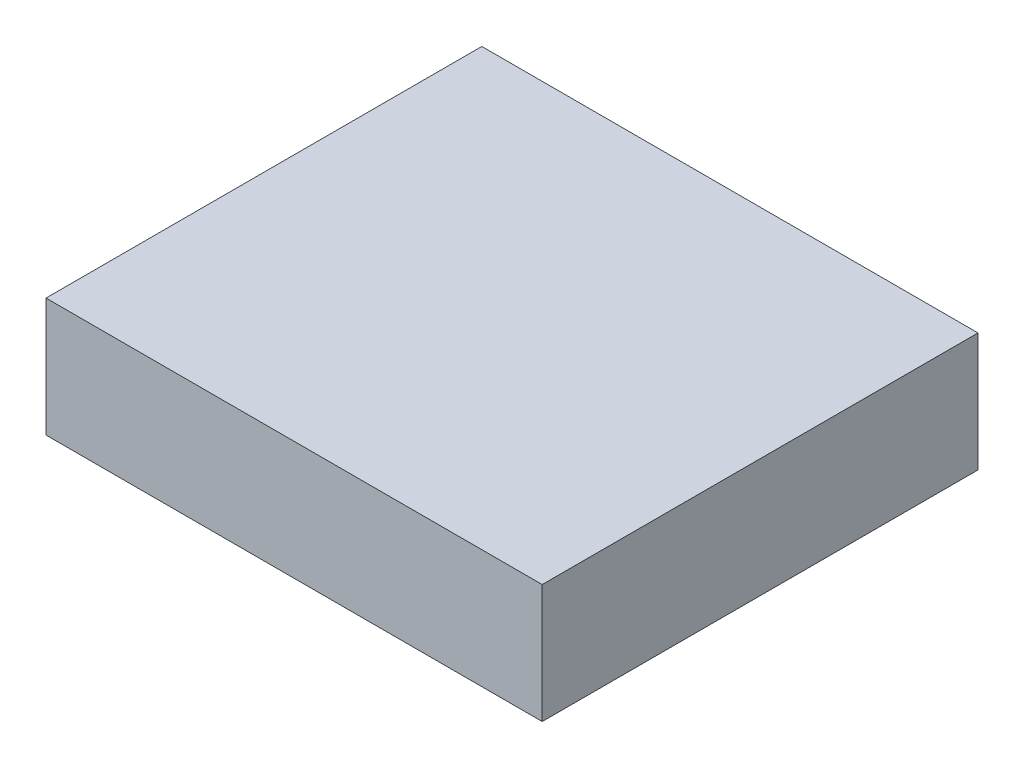
ISO-10303-21;
HEADER;
FILE_DESCRIPTION(('STEP AP214'),'2;1');
FILE_NAME('part.step','',(''),(''),'','','');
FILE_SCHEMA(('AUTOMOTIVE_DESIGN { 1 0 10303 214 1 1 1 1 }'));
ENDSEC;
DATA;
#1=APPLICATION_CONTEXT('core data for automotive mechanical design processes');
#2=APPLICATION_PROTOCOL_DEFINITION('international standard','automotive_design',2000,#1);
#3=PRODUCT_CONTEXT('',#1,'mechanical');
#4=PRODUCT('Part','Part','',(#3));
#5=PRODUCT_RELATED_PRODUCT_CATEGORY('part','',(#4));
#6=PRODUCT_DEFINITION_FORMATION('','',#4);
#7=PRODUCT_DEFINITION_CONTEXT('part definition',#1,'design');
#8=PRODUCT_DEFINITION('design','',#6,#7);
#9=PRODUCT_DEFINITION_SHAPE('','',#8);
#10=(LENGTH_UNIT() NAMED_UNIT(*) SI_UNIT(.MILLI.,.METRE.));
#11=(NAMED_UNIT(*) PLANE_ANGLE_UNIT() SI_UNIT($,.RADIAN.));
#12=(NAMED_UNIT(*) SI_UNIT($,.STERADIAN.) SOLID_ANGLE_UNIT());
#13=UNCERTAINTY_MEASURE_WITH_UNIT(LENGTH_MEASURE(1.E-05),#10,'distance_accuracy_value','');
#14=(GEOMETRIC_REPRESENTATION_CONTEXT(3) GLOBAL_UNCERTAINTY_ASSIGNED_CONTEXT((#13)) GLOBAL_UNIT_ASSIGNED_CONTEXT((#10,
#11,#12)) REPRESENTATION_CONTEXT('',''));
#15=CARTESIAN_POINT('',(0.,0.,0.));
#16=DIRECTION('',(0.,0.,1.));
#17=DIRECTION('',(1.,0.,0.));
#18=AXIS2_PLACEMENT_3D('',#15,#16,#17);
#19=CARTESIAN_POINT('',(-57.5,0.,50.5));
#20=DIRECTION('',(1.,0.,0.));
#21=DIRECTION('',(0.,0.,-1.));
#22=AXIS2_PLACEMENT_3D('',#19,#20,#21);
#23=PLANE('',#22);
#24=DIRECTION('',(0.,1.,0.));
#25=VECTOR('',#24,1.);
#26=CARTESIAN_POINT('',(-57.5,13.75,50.5));
#27=LINE('',#26,#25);
#28=CARTESIAN_POINT('',(-57.5,0.,50.5));
#29=VERTEX_POINT('',#28);
#30=CARTESIAN_POINT('',(-57.5,27.5,50.5));
#31=VERTEX_POINT('',#30);
#32=EDGE_CURVE('E21',#29,#31,#27,.T.);
#33=ORIENTED_EDGE('',*,*,#32,.T.);
#34=DIRECTION('',(0.,0.,-1.));
#35=VECTOR('',#34,1.);
#36=CARTESIAN_POINT('',(-57.5,27.5,0.));
#37=LINE('',#36,#35);
#38=CARTESIAN_POINT('',(-57.5,27.5,-50.5));
#39=VERTEX_POINT('',#38);
#40=EDGE_CURVE('E56',#31,#39,#37,.T.);
#41=ORIENTED_EDGE('',*,*,#40,.T.);
#42=DIRECTION('',(0.,-1.,0.));
#43=VECTOR('',#42,1.);
#44=CARTESIAN_POINT('',(-57.5,13.75,-50.5));
#45=LINE('',#44,#43);
#46=CARTESIAN_POINT('',(-57.5,0.,-50.5));
#47=VERTEX_POINT('',#46);
#48=EDGE_CURVE('E77',#39,#47,#45,.T.);
#49=ORIENTED_EDGE('',*,*,#48,.T.);
#50=DIRECTION('',(0.,0.,-1.));
#51=VECTOR('',#50,1.);
#52=CARTESIAN_POINT('',(-57.5,0.,0.));
#53=LINE('',#52,#51);
#54=EDGE_CURVE('E59',#29,#47,#53,.T.);
#55=ORIENTED_EDGE('',*,*,#54,.F.);
#56=EDGE_LOOP('',(#33,#41,#49,#55));
#57=FACE_BOUND('',#56,.T.);
#58=ADVANCED_FACE('F17',(#57),#23,.F.);
#59=CARTESIAN_POINT('',(57.5,0.,50.5));
#60=DIRECTION('',(0.,0.,-1.));
#61=DIRECTION('',(-1.,0.,0.));
#62=AXIS2_PLACEMENT_3D('',#59,#60,#61);
#63=PLANE('',#62);
#64=DIRECTION('',(0.,1.,0.));
#65=VECTOR('',#64,1.);
#66=CARTESIAN_POINT('',(57.5,13.75,50.5));
#67=LINE('',#66,#65);
#68=CARTESIAN_POINT('',(57.5,0.,50.5));
#69=VERTEX_POINT('',#68);
#70=CARTESIAN_POINT('',(57.5,27.5,50.5));
#71=VERTEX_POINT('',#70);
#72=EDGE_CURVE('E74',#69,#71,#67,.T.);
#73=ORIENTED_EDGE('',*,*,#72,.T.);
#74=DIRECTION('',(-1.,0.,0.));
#75=VECTOR('',#74,1.);
#76=CARTESIAN_POINT('',(0.,27.5,50.5));
#77=LINE('',#76,#75);
#78=EDGE_CURVE('E64',#71,#31,#77,.T.);
#79=ORIENTED_EDGE('',*,*,#78,.T.);
#80=ORIENTED_EDGE('',*,*,#32,.F.);
#81=DIRECTION('',(-1.,0.,0.));
#82=VECTOR('',#81,1.);
#83=CARTESIAN_POINT('',(0.,0.,50.5));
#84=LINE('',#83,#82);
#85=EDGE_CURVE('E79',#69,#29,#84,.T.);
#86=ORIENTED_EDGE('',*,*,#85,.F.);
#87=EDGE_LOOP('',(#73,#79,#80,#86));
#88=FACE_BOUND('',#87,.T.);
#89=ADVANCED_FACE('F73',(#88),#63,.F.);
#90=CARTESIAN_POINT('',(-57.5,27.5,50.5));
#91=DIRECTION('',(0.,-1.,0.));
#92=DIRECTION('',(0.,0.,-1.));
#93=AXIS2_PLACEMENT_3D('',#90,#91,#92);
#94=PLANE('',#93);
#95=DIRECTION('',(-1.,0.,0.));
#96=VECTOR('',#95,1.);
#97=CARTESIAN_POINT('',(0.,27.5,-50.5));
#98=LINE('',#97,#96);
#99=CARTESIAN_POINT('',(57.5,27.5,-50.5));
#100=VERTEX_POINT('',#99);
#101=EDGE_CURVE('E70',#100,#39,#98,.T.);
#102=ORIENTED_EDGE('',*,*,#101,.T.);
#103=ORIENTED_EDGE('',*,*,#40,.F.);
#104=ORIENTED_EDGE('',*,*,#78,.F.);
#105=DIRECTION('',(0.,0.,-1.));
#106=VECTOR('',#105,1.);
#107=CARTESIAN_POINT('',(57.5,27.5,0.));
#108=LINE('',#107,#106);
#109=EDGE_CURVE('E84',#71,#100,#108,.T.);
#110=ORIENTED_EDGE('',*,*,#109,.T.);
#111=EDGE_LOOP('',(#102,#103,#104,#110));
#112=FACE_BOUND('',#111,.T.);
#113=ADVANCED_FACE('F67',(#112),#94,.F.);
#114=CARTESIAN_POINT('',(-57.5,0.,-50.5));
#115=DIRECTION('',(0.,0.,1.));
#116=DIRECTION('',(1.,0.,0.));
#117=AXIS2_PLACEMENT_3D('',#114,#115,#116);
#118=PLANE('',#117);
#119=ORIENTED_EDGE('',*,*,#48,.F.);
#120=ORIENTED_EDGE('',*,*,#101,.F.);
#121=DIRECTION('',(0.,-1.,0.));
#122=VECTOR('',#121,1.);
#123=CARTESIAN_POINT('',(57.5,13.75,-50.5));
#124=LINE('',#123,#122);
#125=CARTESIAN_POINT('',(57.5,0.,-50.5));
#126=VERTEX_POINT('',#125);
#127=EDGE_CURVE('E27',#100,#126,#124,.T.);
#128=ORIENTED_EDGE('',*,*,#127,.T.);
#129=DIRECTION('',(1.,0.,0.));
#130=VECTOR('',#129,1.);
#131=CARTESIAN_POINT('',(0.,0.,-50.5));
#132=LINE('',#131,#130);
#133=EDGE_CURVE('E35',#47,#126,#132,.T.);
#134=ORIENTED_EDGE('',*,*,#133,.F.);
#135=EDGE_LOOP('',(#119,#120,#128,#134));
#136=FACE_BOUND('',#135,.T.);
#137=ADVANCED_FACE('F89',(#136),#118,.F.);
#138=CARTESIAN_POINT('',(-57.5,0.,50.5));
#139=DIRECTION('',(0.,-1.,0.));
#140=DIRECTION('',(0.,0.,-1.));
#141=AXIS2_PLACEMENT_3D('',#138,#139,#140);
#142=PLANE('',#141);
#143=ORIENTED_EDGE('',*,*,#54,.T.);
#144=ORIENTED_EDGE('',*,*,#133,.T.);
#145=DIRECTION('',(0.,0.,1.));
#146=VECTOR('',#145,1.);
#147=CARTESIAN_POINT('',(57.5,0.,0.));
#148=LINE('',#147,#146);
#149=EDGE_CURVE('E11',#126,#69,#148,.T.);
#150=ORIENTED_EDGE('',*,*,#149,.T.);
#151=ORIENTED_EDGE('',*,*,#85,.T.);
#152=EDGE_LOOP('',(#143,#144,#150,#151));
#153=FACE_BOUND('',#152,.T.);
#154=ADVANCED_FACE('F91',(#153),#142,.T.);
#155=CARTESIAN_POINT('',(57.5,0.,-50.5));
#156=DIRECTION('',(-1.,0.,0.));
#157=DIRECTION('',(0.,0.,1.));
#158=AXIS2_PLACEMENT_3D('',#155,#156,#157);
#159=PLANE('',#158);
#160=ORIENTED_EDGE('',*,*,#127,.F.);
#161=ORIENTED_EDGE('',*,*,#109,.F.);
#162=ORIENTED_EDGE('',*,*,#72,.F.);
#163=ORIENTED_EDGE('',*,*,#149,.F.);
#164=EDGE_LOOP('',(#160,#161,#162,#163));
#165=FACE_BOUND('',#164,.T.);
#166=ADVANCED_FACE('F19',(#165),#159,.F.);
#167=CLOSED_SHELL('',(#58,#89,#113,#137,#154,#166));
#168=MANIFOLD_SOLID_BREP('B1',#167);
#169=ADVANCED_BREP_SHAPE_REPRESENTATION('',(#18,#168),#14);
#170=SHAPE_DEFINITION_REPRESENTATION(#9,#169);
ENDSEC;
END-ISO-10303-21;
